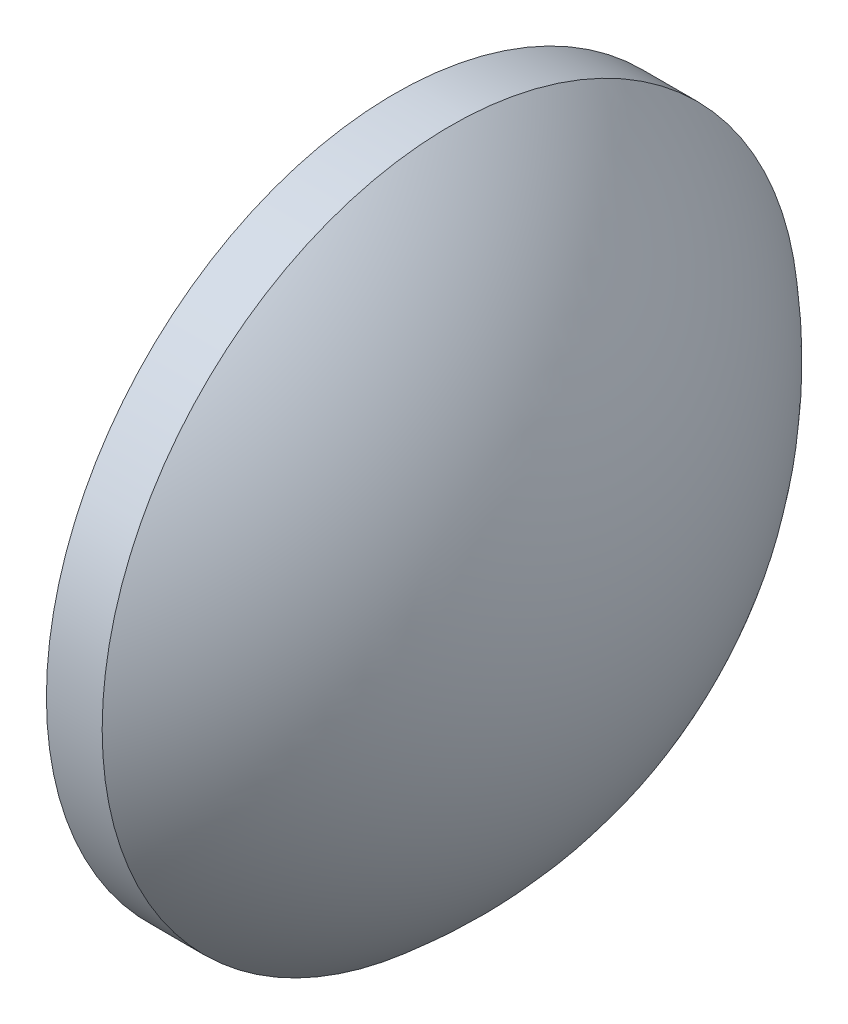
ISO-10303-21;
HEADER;
FILE_DESCRIPTION(('STEP AP214'),'2;1');
FILE_NAME('part.step','',(''),(''),'','','');
FILE_SCHEMA(('AUTOMOTIVE_DESIGN { 1 0 10303 214 1 1 1 1 }'));
ENDSEC;
DATA;
#1=APPLICATION_CONTEXT('core data for automotive mechanical design processes');
#2=APPLICATION_PROTOCOL_DEFINITION('international standard','automotive_design',2000,#1);
#3=PRODUCT_CONTEXT('',#1,'mechanical');
#4=PRODUCT('Part','Part','',(#3));
#5=PRODUCT_RELATED_PRODUCT_CATEGORY('part','',(#4));
#6=PRODUCT_DEFINITION_FORMATION('','',#4);
#7=PRODUCT_DEFINITION_CONTEXT('part definition',#1,'design');
#8=PRODUCT_DEFINITION('design','',#6,#7);
#9=PRODUCT_DEFINITION_SHAPE('','',#8);
#10=(LENGTH_UNIT() NAMED_UNIT(*) SI_UNIT(.MILLI.,.METRE.));
#11=(NAMED_UNIT(*) PLANE_ANGLE_UNIT() SI_UNIT($,.RADIAN.));
#12=(NAMED_UNIT(*) SI_UNIT($,.STERADIAN.) SOLID_ANGLE_UNIT());
#13=UNCERTAINTY_MEASURE_WITH_UNIT(LENGTH_MEASURE(1.E-05),#10,'distance_accuracy_value','');
#14=(GEOMETRIC_REPRESENTATION_CONTEXT(3) GLOBAL_UNCERTAINTY_ASSIGNED_CONTEXT((#13)) GLOBAL_UNIT_ASSIGNED_CONTEXT((#10,
#11,#12)) REPRESENTATION_CONTEXT('',''));
#15=CARTESIAN_POINT('',(0.,0.,0.));
#16=DIRECTION('',(0.,0.,1.));
#17=DIRECTION('',(1.,0.,0.));
#18=AXIS2_PLACEMENT_3D('',#15,#16,#17);
#19=CARTESIAN_POINT('',(400.90638166887,-5.22920143275541,0.));
#20=DIRECTION('',(-1.,0.,0.));
#21=DIRECTION('',(0.,-1.,0.));
#22=AXIS2_PLACEMENT_3D('',#19,#20,#21);
#23=SPHERICAL_SURFACE('',#22,16.2619112627986);
#24=CARTESIAN_POINT('',(411.308292931668,-5.22920143275542,0.));
#25=DIRECTION('',(-1.,0.,0.));
#26=DIRECTION('',(0.,0.,1.));
#27=AXIS2_PLACEMENT_3D('',#24,#25,#26);
#28=CIRCLE('',#27,12.5);
#29=CARTESIAN_POINT('',(411.308292931668,-5.22920143275542,12.5));
#30=VERTEX_POINT('',#29);
#31=EDGE_CURVE('E10',#30,#30,#28,.T.);
#32=ORIENTED_EDGE('',*,*,#31,.F.);
#33=EDGE_LOOP('',(#32));
#34=FACE_BOUND('',#33,.T.);
#35=ADVANCED_FACE('F35',(#34),#23,.T.);
#36=CARTESIAN_POINT('',(407.279185353231,-5.22920143275542,0.));
#37=DIRECTION('',(-1.,0.,0.));
#38=DIRECTION('',(0.,0.,1.));
#39=AXIS2_PLACEMENT_3D('',#36,#37,#38);
#40=CYLINDRICAL_SURFACE('',#39,12.5);
#41=CARTESIAN_POINT('',(409.308292931668,-5.22920143275542,0.));
#42=DIRECTION('',(-1.,0.,0.));
#43=DIRECTION('',(0.,0.,1.));
#44=AXIS2_PLACEMENT_3D('',#41,#42,#43);
#45=CIRCLE('',#44,12.5);
#46=CARTESIAN_POINT('',(409.308292931668,-5.22920143275542,12.5));
#47=VERTEX_POINT('',#46);
#48=EDGE_CURVE('E41',#47,#47,#45,.T.);
#49=ORIENTED_EDGE('',*,*,#48,.F.);
#50=EDGE_LOOP('',(#49));
#51=FACE_BOUND('',#50,.T.);
#52=ORIENTED_EDGE('',*,*,#31,.T.);
#53=EDGE_LOOP('',(#52));
#54=FACE_BOUND('',#53,.T.);
#55=ADVANCED_FACE('F49',(#51,#54),#40,.T.);
#56=CARTESIAN_POINT('',(409.308292931668,-5.22920143275542,0.));
#57=DIRECTION('',(1.,0.,0.));
#58=DIRECTION('',(0.,0.,-1.));
#59=AXIS2_PLACEMENT_3D('',#56,#57,#58);
#60=PLANE('',#59);
#61=ORIENTED_EDGE('',*,*,#48,.T.);
#62=EDGE_LOOP('',(#61));
#63=FACE_BOUND('',#62,.T.);
#64=ADVANCED_FACE('F47',(#63),#60,.F.);
#65=CLOSED_SHELL('',(#35,#55,#64));
#66=MANIFOLD_SOLID_BREP('B2',#65);
#67=ADVANCED_BREP_SHAPE_REPRESENTATION('',(#18,#66),#14);
#68=SHAPE_DEFINITION_REPRESENTATION(#9,#67);
ENDSEC;
END-ISO-10303-21;
